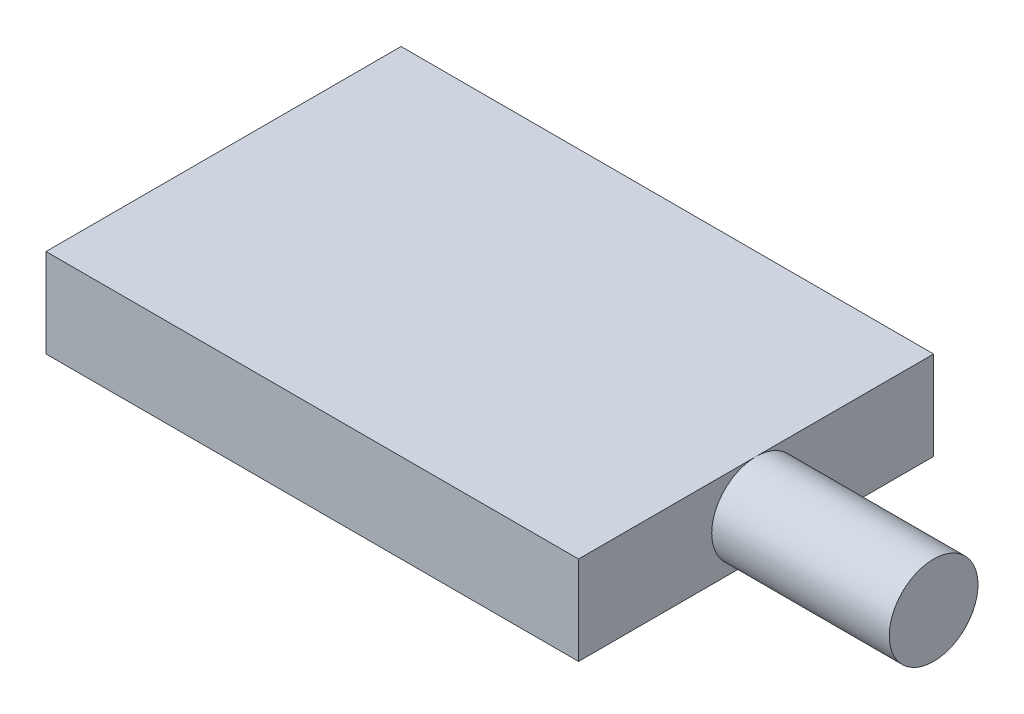
ISO-10303-21;
HEADER;
FILE_DESCRIPTION(('STEP AP214'),'2;1');
FILE_NAME('part.step','',(''),(''),'','','');
FILE_SCHEMA(('AUTOMOTIVE_DESIGN { 1 0 10303 214 1 1 1 1 }'));
ENDSEC;
DATA;
#1=APPLICATION_CONTEXT('core data for automotive mechanical design processes');
#2=APPLICATION_PROTOCOL_DEFINITION('international standard','automotive_design',2000,#1);
#3=PRODUCT_CONTEXT('',#1,'mechanical');
#4=PRODUCT('Part','Part','',(#3));
#5=PRODUCT_RELATED_PRODUCT_CATEGORY('part','',(#4));
#6=PRODUCT_DEFINITION_FORMATION('','',#4);
#7=PRODUCT_DEFINITION_CONTEXT('part definition',#1,'design');
#8=PRODUCT_DEFINITION('design','',#6,#7);
#9=PRODUCT_DEFINITION_SHAPE('','',#8);
#10=(LENGTH_UNIT() NAMED_UNIT(*) SI_UNIT(.MILLI.,.METRE.));
#11=(NAMED_UNIT(*) PLANE_ANGLE_UNIT() SI_UNIT($,.RADIAN.));
#12=(NAMED_UNIT(*) SI_UNIT($,.STERADIAN.) SOLID_ANGLE_UNIT());
#13=UNCERTAINTY_MEASURE_WITH_UNIT(LENGTH_MEASURE(1.E-05),#10,'distance_accuracy_value','');
#14=(GEOMETRIC_REPRESENTATION_CONTEXT(3) GLOBAL_UNCERTAINTY_ASSIGNED_CONTEXT((#13)) GLOBAL_UNIT_ASSIGNED_CONTEXT((#10,
#11,#12)) REPRESENTATION_CONTEXT('',''));
#15=CARTESIAN_POINT('',(0.,0.,0.));
#16=DIRECTION('',(0.,0.,1.));
#17=DIRECTION('',(1.,0.,0.));
#18=AXIS2_PLACEMENT_3D('',#15,#16,#17);
#19=CARTESIAN_POINT('',(30.,5.,0.));
#20=DIRECTION('',(-1.,0.,0.));
#21=DIRECTION('',(0.,0.,1.));
#22=AXIS2_PLACEMENT_3D('',#19,#20,#21);
#23=PLANE('',#22);
#24=CARTESIAN_POINT('',(30.,2.5,-10.));
#25=DIRECTION('',(1.,0.,0.));
#26=DIRECTION('',(0.,0.,-1.));
#27=AXIS2_PLACEMENT_3D('',#24,#25,#26);
#28=CIRCLE('',#27,2.5);
#29=CARTESIAN_POINT('',(30.,5.,-10.));
#30=VERTEX_POINT('',#29);
#31=CARTESIAN_POINT('',(30.,0.,-10.));
#32=VERTEX_POINT('',#31);
#33=EDGE_CURVE('E48',#30,#32,#28,.T.);
#34=ORIENTED_EDGE('',*,*,#33,.F.);
#35=DIRECTION('',(0.,0.,-1.));
#36=VECTOR('',#35,1.);
#37=CARTESIAN_POINT('',(30.,5.,0.));
#38=LINE('',#37,#36);
#39=CARTESIAN_POINT('',(30.,5.,0.));
#40=VERTEX_POINT('',#39);
#41=EDGE_CURVE('E94',#40,#30,#38,.T.);
#42=ORIENTED_EDGE('',*,*,#41,.F.);
#43=DIRECTION('',(0.,-1.,0.));
#44=VECTOR('',#43,1.);
#45=CARTESIAN_POINT('',(30.,5.,0.));
#46=LINE('',#45,#44);
#47=CARTESIAN_POINT('',(30.,0.,0.));
#48=VERTEX_POINT('',#47);
#49=EDGE_CURVE('E143',#40,#48,#46,.T.);
#50=ORIENTED_EDGE('',*,*,#49,.T.);
#51=DIRECTION('',(0.,0.,-1.));
#52=VECTOR('',#51,1.);
#53=CARTESIAN_POINT('',(30.,0.,0.));
#54=LINE('',#53,#52);
#55=EDGE_CURVE('E107',#48,#32,#54,.T.);
#56=ORIENTED_EDGE('',*,*,#55,.T.);
#57=EDGE_LOOP('',(#34,#42,#50,#56));
#58=FACE_BOUND('',#57,.T.);
#59=ADVANCED_FACE('F38',(#58),#23,.F.);
#60=CARTESIAN_POINT('',(0.,5.,0.));
#61=DIRECTION('',(1.,0.,0.));
#62=DIRECTION('',(0.,0.,-1.));
#63=AXIS2_PLACEMENT_3D('',#60,#61,#62);
#64=PLANE('',#63);
#65=DIRECTION('',(0.,0.,1.));
#66=VECTOR('',#65,1.);
#67=CARTESIAN_POINT('',(0.,0.,0.));
#68=LINE('',#67,#66);
#69=CARTESIAN_POINT('',(0.,0.,-20.));
#70=VERTEX_POINT('',#69);
#71=CARTESIAN_POINT('',(0.,0.,0.));
#72=VERTEX_POINT('',#71);
#73=EDGE_CURVE('E148',#70,#72,#68,.T.);
#74=ORIENTED_EDGE('',*,*,#73,.T.);
#75=DIRECTION('',(0.,-1.,0.));
#76=VECTOR('',#75,1.);
#77=CARTESIAN_POINT('',(0.,5.,0.));
#78=LINE('',#77,#76);
#79=CARTESIAN_POINT('',(0.,5.,0.));
#80=VERTEX_POINT('',#79);
#81=EDGE_CURVE('E42',#80,#72,#78,.T.);
#82=ORIENTED_EDGE('',*,*,#81,.F.);
#83=DIRECTION('',(0.,0.,1.));
#84=VECTOR('',#83,1.);
#85=CARTESIAN_POINT('',(0.,5.,0.));
#86=LINE('',#85,#84);
#87=CARTESIAN_POINT('',(0.,5.,-20.));
#88=VERTEX_POINT('',#87);
#89=EDGE_CURVE('E151',#88,#80,#86,.T.);
#90=ORIENTED_EDGE('',*,*,#89,.F.);
#91=DIRECTION('',(0.,-1.,0.));
#92=VECTOR('',#91,1.);
#93=CARTESIAN_POINT('',(0.,5.,-20.));
#94=LINE('',#93,#92);
#95=EDGE_CURVE('E155',#88,#70,#94,.T.);
#96=ORIENTED_EDGE('',*,*,#95,.T.);
#97=EDGE_LOOP('',(#74,#82,#90,#96));
#98=FACE_BOUND('',#97,.T.);
#99=ADVANCED_FACE('F40',(#98),#64,.F.);
#100=CARTESIAN_POINT('',(0.,5.,0.));
#101=DIRECTION('',(0.,0.,-1.));
#102=DIRECTION('',(-1.,0.,0.));
#103=AXIS2_PLACEMENT_3D('',#100,#101,#102);
#104=PLANE('',#103);
#105=DIRECTION('',(1.,0.,0.));
#106=VECTOR('',#105,1.);
#107=CARTESIAN_POINT('',(0.,0.,0.));
#108=LINE('',#107,#106);
#109=EDGE_CURVE('E142',#72,#48,#108,.T.);
#110=ORIENTED_EDGE('',*,*,#109,.T.);
#111=ORIENTED_EDGE('',*,*,#49,.F.);
#112=DIRECTION('',(1.,0.,0.));
#113=VECTOR('',#112,1.);
#114=CARTESIAN_POINT('',(0.,5.,0.));
#115=LINE('',#114,#113);
#116=EDGE_CURVE('E90',#80,#40,#115,.T.);
#117=ORIENTED_EDGE('',*,*,#116,.F.);
#118=ORIENTED_EDGE('',*,*,#81,.T.);
#119=EDGE_LOOP('',(#110,#111,#117,#118));
#120=FACE_BOUND('',#119,.T.);
#121=ADVANCED_FACE('F131',(#120),#104,.F.);
#122=EDGE_CURVE('E11',#32,#30,#28,.T.);
#123=ORIENTED_EDGE('',*,*,#122,.F.);
#124=CARTESIAN_POINT('',(30.,0.,-20.));
#125=VERTEX_POINT('',#124);
#126=EDGE_CURVE('E147',#32,#125,#54,.T.);
#127=ORIENTED_EDGE('',*,*,#126,.T.);
#128=DIRECTION('',(0.,-1.,0.));
#129=VECTOR('',#128,1.);
#130=CARTESIAN_POINT('',(30.,5.,-20.));
#131=LINE('',#130,#129);
#132=CARTESIAN_POINT('',(30.,5.,-20.));
#133=VERTEX_POINT('',#132);
#134=EDGE_CURVE('E103',#133,#125,#131,.T.);
#135=ORIENTED_EDGE('',*,*,#134,.F.);
#136=EDGE_CURVE('E96',#30,#133,#38,.T.);
#137=ORIENTED_EDGE('',*,*,#136,.F.);
#138=EDGE_LOOP('',(#123,#127,#135,#137));
#139=FACE_BOUND('',#138,.T.);
#140=ADVANCED_FACE('F102',(#139),#23,.F.);
#141=CARTESIAN_POINT('',(0.,5.,-20.));
#142=DIRECTION('',(0.,0.,1.));
#143=DIRECTION('',(1.,0.,0.));
#144=AXIS2_PLACEMENT_3D('',#141,#142,#143);
#145=PLANE('',#144);
#146=DIRECTION('',(-1.,0.,0.));
#147=VECTOR('',#146,1.);
#148=CARTESIAN_POINT('',(0.,0.,-20.));
#149=LINE('',#148,#147);
#150=EDGE_CURVE('E82',#125,#70,#149,.T.);
#151=ORIENTED_EDGE('',*,*,#150,.T.);
#152=ORIENTED_EDGE('',*,*,#95,.F.);
#153=DIRECTION('',(-1.,0.,0.));
#154=VECTOR('',#153,1.);
#155=CARTESIAN_POINT('',(0.,5.,-20.));
#156=LINE('',#155,#154);
#157=EDGE_CURVE('E62',#133,#88,#156,.T.);
#158=ORIENTED_EDGE('',*,*,#157,.F.);
#159=ORIENTED_EDGE('',*,*,#134,.T.);
#160=EDGE_LOOP('',(#151,#152,#158,#159));
#161=FACE_BOUND('',#160,.T.);
#162=ADVANCED_FACE('F135',(#161),#145,.F.);
#163=CARTESIAN_POINT('',(0.,5.,0.));
#164=DIRECTION('',(0.,-1.,0.));
#165=DIRECTION('',(0.,0.,-1.));
#166=AXIS2_PLACEMENT_3D('',#163,#164,#165);
#167=PLANE('',#166);
#168=ORIENTED_EDGE('',*,*,#89,.T.);
#169=ORIENTED_EDGE('',*,*,#116,.T.);
#170=ORIENTED_EDGE('',*,*,#41,.T.);
#171=ORIENTED_EDGE('',*,*,#136,.T.);
#172=ORIENTED_EDGE('',*,*,#157,.T.);
#173=EDGE_LOOP('',(#168,#169,#170,#171,#172));
#174=FACE_BOUND('',#173,.T.);
#175=ADVANCED_FACE('F95',(#174),#167,.F.);
#176=CARTESIAN_POINT('',(0.,0.,0.));
#177=DIRECTION('',(0.,-1.,0.));
#178=DIRECTION('',(0.,0.,-1.));
#179=AXIS2_PLACEMENT_3D('',#176,#177,#178);
#180=PLANE('',#179);
#181=ORIENTED_EDGE('',*,*,#73,.F.);
#182=ORIENTED_EDGE('',*,*,#150,.F.);
#183=ORIENTED_EDGE('',*,*,#126,.F.);
#184=ORIENTED_EDGE('',*,*,#55,.F.);
#185=ORIENTED_EDGE('',*,*,#109,.F.);
#186=EDGE_LOOP('',(#181,#182,#183,#184,#185));
#187=FACE_BOUND('',#186,.T.);
#188=ADVANCED_FACE('F113',(#187),#180,.T.);
#189=CARTESIAN_POINT('',(40.,2.5,-10.));
#190=DIRECTION('',(-1.,0.,0.));
#191=DIRECTION('',(0.,0.,1.));
#192=AXIS2_PLACEMENT_3D('',#189,#190,#191);
#193=CYLINDRICAL_SURFACE('',#192,2.5);
#194=CARTESIAN_POINT('',(40.,2.5,-10.));
#195=DIRECTION('',(1.,0.,0.));
#196=DIRECTION('',(0.,0.,-1.));
#197=AXIS2_PLACEMENT_3D('',#194,#195,#196);
#198=CIRCLE('',#197,2.5);
#199=CARTESIAN_POINT('',(40.,2.5,-12.5));
#200=VERTEX_POINT('',#199);
#201=EDGE_CURVE('E109',#200,#200,#198,.T.);
#202=ORIENTED_EDGE('',*,*,#201,.F.);
#203=EDGE_LOOP('',(#202));
#204=FACE_BOUND('',#203,.T.);
#205=ORIENTED_EDGE('',*,*,#33,.T.);
#206=ORIENTED_EDGE('',*,*,#122,.T.);
#207=EDGE_LOOP('',(#205,#206));
#208=FACE_BOUND('',#207,.T.);
#209=ADVANCED_FACE('F110',(#204,#208),#193,.T.);
#210=CARTESIAN_POINT('',(40.,2.5,-10.));
#211=DIRECTION('',(1.,0.,0.));
#212=DIRECTION('',(0.,0.,-1.));
#213=AXIS2_PLACEMENT_3D('',#210,#211,#212);
#214=PLANE('',#213);
#215=ORIENTED_EDGE('',*,*,#201,.T.);
#216=EDGE_LOOP('',(#215));
#217=FACE_BOUND('',#216,.T.);
#218=ADVANCED_FACE('F112',(#217),#214,.T.);
#219=CLOSED_SHELL('',(#59,#99,#121,#140,#162,#175,#188,#209,#218));
#220=MANIFOLD_SOLID_BREP('B2',#219);
#221=ADVANCED_BREP_SHAPE_REPRESENTATION('',(#18,#220),#14);
#222=SHAPE_DEFINITION_REPRESENTATION(#9,#221);
ENDSEC;
END-ISO-10303-21;
